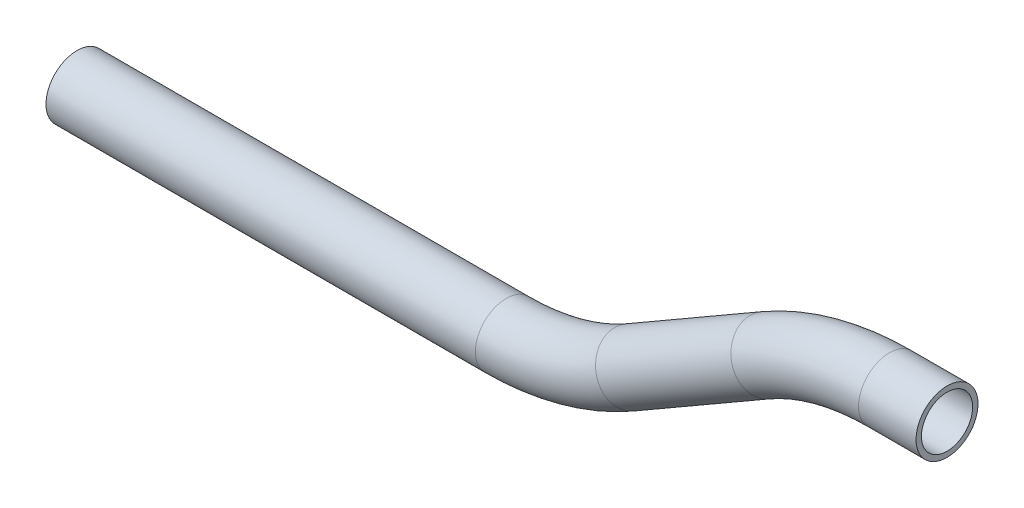
ISO-10303-21;
HEADER;
FILE_DESCRIPTION(('STEP AP214'),'2;1');
FILE_NAME('part.step','',(''),(''),'','','');
FILE_SCHEMA(('AUTOMOTIVE_DESIGN { 1 0 10303 214 1 1 1 1 }'));
ENDSEC;
DATA;
#1=APPLICATION_CONTEXT('core data for automotive mechanical design processes');
#2=APPLICATION_PROTOCOL_DEFINITION('international standard','automotive_design',2000,#1);
#3=PRODUCT_CONTEXT('',#1,'mechanical');
#4=PRODUCT('Part','Part','',(#3));
#5=PRODUCT_RELATED_PRODUCT_CATEGORY('part','',(#4));
#6=PRODUCT_DEFINITION_FORMATION('','',#4);
#7=PRODUCT_DEFINITION_CONTEXT('part definition',#1,'design');
#8=PRODUCT_DEFINITION('design','',#6,#7);
#9=PRODUCT_DEFINITION_SHAPE('','',#8);
#10=(LENGTH_UNIT() NAMED_UNIT(*) SI_UNIT(.MILLI.,.METRE.));
#11=(NAMED_UNIT(*) PLANE_ANGLE_UNIT() SI_UNIT($,.RADIAN.));
#12=(NAMED_UNIT(*) SI_UNIT($,.STERADIAN.) SOLID_ANGLE_UNIT());
#13=UNCERTAINTY_MEASURE_WITH_UNIT(LENGTH_MEASURE(1.E-05),#10,'distance_accuracy_value','');
#14=(GEOMETRIC_REPRESENTATION_CONTEXT(3) GLOBAL_UNCERTAINTY_ASSIGNED_CONTEXT((#13)) GLOBAL_UNIT_ASSIGNED_CONTEXT((#10,
#11,#12)) REPRESENTATION_CONTEXT('',''));
#15=CARTESIAN_POINT('',(0.,0.,0.));
#16=DIRECTION('',(0.,0.,1.));
#17=DIRECTION('',(1.,0.,0.));
#18=AXIS2_PLACEMENT_3D('',#15,#16,#17);
#19=CARTESIAN_POINT('',(45.2161884712732,15.1508063567214,0.));
#20=DIRECTION('',(-1.,0.,0.));
#21=DIRECTION('',(0.,-1.,0.));
#22=AXIS2_PLACEMENT_3D('',#19,#20,#21);
#23=CYLINDRICAL_SURFACE('',#22,9.525);
#24=CARTESIAN_POINT('',(27.5339169345249,15.1508063567214,0.));
#25=DIRECTION('',(-1.,0.,0.));
#26=DIRECTION('',(0.,-1.,0.));
#27=AXIS2_PLACEMENT_3D('',#24,#25,#26);
#28=CIRCLE('',#27,9.525);
#29=CARTESIAN_POINT('',(27.5339169345249,24.6758063567214,0.));
#30=VERTEX_POINT('',#29);
#31=EDGE_CURVE('E65',#30,#30,#28,.T.);
#32=ORIENTED_EDGE('',*,*,#31,.F.);
#33=EDGE_LOOP('',(#32));
#34=FACE_BOUND('',#33,.T.);
#35=CARTESIAN_POINT('',(45.2161884712732,15.1508063567214,0.));
#36=DIRECTION('',(-1.,0.,0.));
#37=DIRECTION('',(0.,-1.,0.));
#38=AXIS2_PLACEMENT_3D('',#35,#36,#37);
#39=CIRCLE('',#38,9.525);
#40=CARTESIAN_POINT('',(45.2161884712732,5.62580635672139,0.));
#41=VERTEX_POINT('',#40);
#42=EDGE_CURVE('E61',#41,#41,#39,.T.);
#43=ORIENTED_EDGE('',*,*,#42,.T.);
#44=EDGE_LOOP('',(#43));
#45=FACE_BOUND('',#44,.T.);
#46=ADVANCED_FACE('F37',(#34,#45),#23,.T.);
#47=CARTESIAN_POINT('',(27.5339169345249,-61.0491936432786,0.));
#48=DIRECTION('',(0.,0.,1.));
#49=DIRECTION('',(1.,0.,0.));
#50=AXIS2_PLACEMENT_3D('',#47,#48,#49);
#51=TOROIDAL_SURFACE('',#50,76.2,9.525);
#52=CARTESIAN_POINT('',(-10.5660830654752,4.94194212509554,0.));
#53=DIRECTION('',(-0.866025403784438,-0.500000000000001,0.));
#54=DIRECTION('',(0.500000000000001,-0.866025403784438,0.));
#55=AXIS2_PLACEMENT_3D('',#52,#53,#54);
#56=CIRCLE('',#55,9.525);
#57=CARTESIAN_POINT('',(-15.3285830654752,13.1908340961423,0.));
#58=VERTEX_POINT('',#57);
#59=EDGE_CURVE('E69',#58,#58,#56,.T.);
#60=CARTESIAN_POINT('',(27.5339169345249,-61.0491936432786,0.));
#61=DIRECTION('',(0.,0.,1.));
#62=DIRECTION('',(1.,0.,0.));
#63=AXIS2_PLACEMENT_3D('',#60,#61,#62);
#64=CIRCLE('',#63,85.725);
#65=EDGE_CURVE('',#30,#58,#64,.T.);
#66=ORIENTED_EDGE('',*,*,#31,.T.);
#67=ORIENTED_EDGE('',*,*,#59,.F.);
#68=ORIENTED_EDGE('',*,*,#65,.T.);
#69=ORIENTED_EDGE('',*,*,#65,.F.);
#70=EDGE_LOOP('',(#66,#68,#67,#69));
#71=FACE_BOUND('',#70,.T.);
#72=ADVANCED_FACE('F91',(#71),#51,.T.);
#73=CARTESIAN_POINT('',(-10.5660830654752,4.94194212509554,0.));
#74=DIRECTION('',(-0.866025403784436,-0.500000000000004,0.));
#75=DIRECTION('',(0.500000000000004,-0.866025403784436,0.));
#76=AXIS2_PLACEMENT_3D('',#73,#74,#75);
#77=CYLINDRICAL_SURFACE('',#76,9.525);
#78=CARTESIAN_POINT('',(-52.1911983884148,-19.0903294116531,0.));
#79=DIRECTION('',(-0.866025403784436,-0.500000000000004,0.));
#80=DIRECTION('',(0.500000000000004,-0.866025403784436,0.));
#81=AXIS2_PLACEMENT_3D('',#78,#79,#80);
#82=CIRCLE('',#81,9.525);
#83=CARTESIAN_POINT('',(-47.4286983884148,-27.3392213826999,0.));
#84=VERTEX_POINT('',#83);
#85=EDGE_CURVE('E72',#84,#84,#82,.T.);
#86=ORIENTED_EDGE('',*,*,#85,.F.);
#87=EDGE_LOOP('',(#86));
#88=FACE_BOUND('',#87,.T.);
#89=ORIENTED_EDGE('',*,*,#59,.T.);
#90=EDGE_LOOP('',(#89));
#91=FACE_BOUND('',#90,.T.);
#92=ADVANCED_FACE('F84',(#88,#91),#77,.T.);
#93=CARTESIAN_POINT('',(-90.2911983884149,46.9008063567211,0.));
#94=DIRECTION('',(0.,0.,-1.));
#95=DIRECTION('',(-1.,0.,0.));
#96=AXIS2_PLACEMENT_3D('',#93,#94,#95);
#97=TOROIDAL_SURFACE('',#96,76.2,9.525);
#98=CARTESIAN_POINT('',(-90.2911983884148,-29.299193643279,0.));
#99=DIRECTION('',(-1.,0.,0.));
#100=DIRECTION('',(0.,-1.,0.));
#101=AXIS2_PLACEMENT_3D('',#98,#99,#100);
#102=CIRCLE('',#101,9.525);
#103=CARTESIAN_POINT('',(-90.2911983884148,-38.8241936432789,0.));
#104=VERTEX_POINT('',#103);
#105=EDGE_CURVE('E41',#104,#104,#102,.T.);
#106=CARTESIAN_POINT('',(-90.2911983884149,46.9008063567211,0.));
#107=DIRECTION('',(0.,0.,-1.));
#108=DIRECTION('',(-1.,0.,0.));
#109=AXIS2_PLACEMENT_3D('',#106,#107,#108);
#110=CIRCLE('',#109,85.725);
#111=EDGE_CURVE('',#84,#104,#110,.T.);
#112=ORIENTED_EDGE('',*,*,#85,.T.);
#113=ORIENTED_EDGE('',*,*,#105,.F.);
#114=ORIENTED_EDGE('',*,*,#111,.T.);
#115=ORIENTED_EDGE('',*,*,#111,.F.);
#116=EDGE_LOOP('',(#112,#114,#113,#115));
#117=FACE_BOUND('',#116,.T.);
#118=ADVANCED_FACE('F82',(#117),#97,.T.);
#119=CARTESIAN_POINT('',(-90.2911983884148,-29.2991936432789,0.));
#120=DIRECTION('',(-1.,0.,0.));
#121=DIRECTION('',(0.,-1.,0.));
#122=AXIS2_PLACEMENT_3D('',#119,#120,#121);
#123=CYLINDRICAL_SURFACE('',#122,9.525);
#124=CARTESIAN_POINT('',(-222.273469925163,-29.2991936432789,0.));
#125=DIRECTION('',(-1.,0.,0.));
#126=DIRECTION('',(0.,-1.,0.));
#127=AXIS2_PLACEMENT_3D('',#124,#125,#126);
#128=CIRCLE('',#127,9.525);
#129=CARTESIAN_POINT('',(-222.273469925163,-38.8241936432789,0.));
#130=VERTEX_POINT('',#129);
#131=EDGE_CURVE('E56',#130,#130,#128,.T.);
#132=ORIENTED_EDGE('',*,*,#131,.F.);
#133=EDGE_LOOP('',(#132));
#134=FACE_BOUND('',#133,.T.);
#135=ORIENTED_EDGE('',*,*,#105,.T.);
#136=EDGE_LOOP('',(#135));
#137=FACE_BOUND('',#136,.T.);
#138=ADVANCED_FACE('F39',(#134,#137),#123,.T.);
#139=CARTESIAN_POINT('',(45.2161884712732,15.1508063567214,0.));
#140=DIRECTION('',(-1.,0.,0.));
#141=DIRECTION('',(0.,-1.,0.));
#142=AXIS2_PLACEMENT_3D('',#139,#140,#141);
#143=PLANE('',#142);
#144=CARTESIAN_POINT('',(45.2161884712732,15.1508063567214,0.));
#145=DIRECTION('',(-1.,0.,0.));
#146=DIRECTION('',(0.,-1.,0.));
#147=AXIS2_PLACEMENT_3D('',#144,#145,#146);
#148=CIRCLE('',#147,7.874);
#149=CARTESIAN_POINT('',(45.2161884712732,7.27680635672139,0.));
#150=VERTEX_POINT('',#149);
#151=EDGE_CURVE('E60',#150,#150,#148,.F.);
#152=ORIENTED_EDGE('',*,*,#151,.F.);
#153=EDGE_LOOP('',(#152));
#154=FACE_BOUND('',#153,.T.);
#155=ORIENTED_EDGE('',*,*,#42,.F.);
#156=EDGE_LOOP('',(#155));
#157=FACE_BOUND('',#156,.T.);
#158=ADVANCED_FACE('F89',(#154,#157),#143,.F.);
#159=CARTESIAN_POINT('',(-222.273469925163,-29.2991936432789,0.));
#160=DIRECTION('',(-1.,0.,0.));
#161=DIRECTION('',(0.,-1.,0.));
#162=AXIS2_PLACEMENT_3D('',#159,#160,#161);
#163=PLANE('',#162);
#164=CARTESIAN_POINT('',(-222.273469925163,-29.2991936432789,0.));
#165=DIRECTION('',(-1.,0.,0.));
#166=DIRECTION('',(0.,-1.,0.));
#167=AXIS2_PLACEMENT_3D('',#164,#165,#166);
#168=CIRCLE('',#167,7.874);
#169=CARTESIAN_POINT('',(-222.273469925163,-37.1731936432789,0.));
#170=VERTEX_POINT('',#169);
#171=EDGE_CURVE('E10',#170,#170,#168,.F.);
#172=ORIENTED_EDGE('',*,*,#171,.T.);
#173=EDGE_LOOP('',(#172));
#174=FACE_BOUND('',#173,.T.);
#175=ORIENTED_EDGE('',*,*,#131,.T.);
#176=EDGE_LOOP('',(#175));
#177=FACE_BOUND('',#176,.T.);
#178=ADVANCED_FACE('F108',(#174,#177),#163,.T.);
#179=CARTESIAN_POINT('',(45.2161884712732,15.1508063567214,0.));
#180=DIRECTION('',(-1.,0.,0.));
#181=DIRECTION('',(0.,-1.,0.));
#182=AXIS2_PLACEMENT_3D('',#179,#180,#181);
#183=CYLINDRICAL_SURFACE('',#182,7.874);
#184=CARTESIAN_POINT('',(27.5339169345249,15.1508063567214,0.));
#185=DIRECTION('',(-1.,0.,0.));
#186=DIRECTION('',(0.,-1.,0.));
#187=AXIS2_PLACEMENT_3D('',#184,#185,#186);
#188=CIRCLE('',#187,7.874);
#189=CARTESIAN_POINT('',(27.5339169345249,23.0248063567214,0.));
#190=VERTEX_POINT('',#189);
#191=EDGE_CURVE('E205',#190,#190,#188,.F.);
#192=ORIENTED_EDGE('',*,*,#191,.F.);
#193=EDGE_LOOP('',(#192));
#194=FACE_BOUND('',#193,.T.);
#195=ORIENTED_EDGE('',*,*,#151,.T.);
#196=EDGE_LOOP('',(#195));
#197=FACE_BOUND('',#196,.T.);
#198=ADVANCED_FACE('F111',(#194,#197),#183,.F.);
#199=CARTESIAN_POINT('',(27.5339169345249,-61.0491936432786,0.));
#200=DIRECTION('',(0.,0.,1.));
#201=DIRECTION('',(1.,0.,0.));
#202=AXIS2_PLACEMENT_3D('',#199,#200,#201);
#203=TOROIDAL_SURFACE('',#202,76.2,7.874);
#204=CARTESIAN_POINT('',(-10.5660830654752,4.94194212509554,0.));
#205=DIRECTION('',(-0.866025403784438,-0.500000000000001,0.));
#206=DIRECTION('',(0.500000000000001,-0.866025403784438,0.));
#207=AXIS2_PLACEMENT_3D('',#204,#205,#206);
#208=CIRCLE('',#207,7.874);
#209=CARTESIAN_POINT('',(-14.5030830654752,11.7610261544942,0.));
#210=VERTEX_POINT('',#209);
#211=EDGE_CURVE('E203',#210,#210,#208,.F.);
#212=CARTESIAN_POINT('',(27.5339169345249,-61.0491936432786,0.));
#213=DIRECTION('',(0.,0.,1.));
#214=DIRECTION('',(1.,0.,0.));
#215=AXIS2_PLACEMENT_3D('',#212,#213,#214);
#216=CIRCLE('',#215,84.074);
#217=EDGE_CURVE('',#190,#210,#216,.T.);
#218=ORIENTED_EDGE('',*,*,#191,.T.);
#219=ORIENTED_EDGE('',*,*,#211,.F.);
#220=ORIENTED_EDGE('',*,*,#217,.T.);
#221=ORIENTED_EDGE('',*,*,#217,.F.);
#222=EDGE_LOOP('',(#218,#220,#219,#221));
#223=FACE_BOUND('',#222,.T.);
#224=ADVANCED_FACE('F166',(#223),#203,.F.);
#225=CARTESIAN_POINT('',(-10.5660830654752,4.94194212509554,0.));
#226=DIRECTION('',(-0.866025403784436,-0.500000000000004,0.));
#227=DIRECTION('',(0.500000000000004,-0.866025403784436,0.));
#228=AXIS2_PLACEMENT_3D('',#225,#226,#227);
#229=CYLINDRICAL_SURFACE('',#228,7.874);
#230=CARTESIAN_POINT('',(-52.1911983884148,-19.0903294116531,0.));
#231=DIRECTION('',(-0.866025403784436,-0.500000000000004,0.));
#232=DIRECTION('',(0.500000000000004,-0.866025403784436,0.));
#233=AXIS2_PLACEMENT_3D('',#230,#231,#232);
#234=CIRCLE('',#233,7.874);
#235=CARTESIAN_POINT('',(-48.2541983884148,-25.9094134410518,0.));
#236=VERTEX_POINT('',#235);
#237=EDGE_CURVE('E52',#236,#236,#234,.F.);
#238=ORIENTED_EDGE('',*,*,#237,.F.);
#239=EDGE_LOOP('',(#238));
#240=FACE_BOUND('',#239,.T.);
#241=ORIENTED_EDGE('',*,*,#211,.T.);
#242=EDGE_LOOP('',(#241));
#243=FACE_BOUND('',#242,.T.);
#244=ADVANCED_FACE('F102',(#240,#243),#229,.F.);
#245=CARTESIAN_POINT('',(-90.2911983884149,46.9008063567211,0.));
#246=DIRECTION('',(0.,0.,-1.));
#247=DIRECTION('',(-1.,0.,0.));
#248=AXIS2_PLACEMENT_3D('',#245,#246,#247);
#249=TOROIDAL_SURFACE('',#248,76.2,7.874);
#250=CARTESIAN_POINT('',(-90.2911983884148,-29.299193643279,0.));
#251=DIRECTION('',(-1.,0.,0.));
#252=DIRECTION('',(0.,-1.,0.));
#253=AXIS2_PLACEMENT_3D('',#250,#251,#252);
#254=CIRCLE('',#253,7.874);
#255=CARTESIAN_POINT('',(-90.2911983884148,-37.1731936432789,0.));
#256=VERTEX_POINT('',#255);
#257=EDGE_CURVE('E46',#256,#256,#254,.F.);
#258=CARTESIAN_POINT('',(-90.2911983884149,46.9008063567211,0.));
#259=DIRECTION('',(0.,0.,-1.));
#260=DIRECTION('',(-1.,0.,0.));
#261=AXIS2_PLACEMENT_3D('',#258,#259,#260);
#262=CIRCLE('',#261,84.074);
#263=EDGE_CURVE('',#236,#256,#262,.T.);
#264=ORIENTED_EDGE('',*,*,#237,.T.);
#265=ORIENTED_EDGE('',*,*,#257,.F.);
#266=ORIENTED_EDGE('',*,*,#263,.T.);
#267=ORIENTED_EDGE('',*,*,#263,.F.);
#268=EDGE_LOOP('',(#264,#266,#265,#267));
#269=FACE_BOUND('',#268,.T.);
#270=ADVANCED_FACE('F96',(#269),#249,.F.);
#271=CARTESIAN_POINT('',(-90.2911983884148,-29.2991936432789,0.));
#272=DIRECTION('',(-1.,0.,0.));
#273=DIRECTION('',(0.,-1.,0.));
#274=AXIS2_PLACEMENT_3D('',#271,#272,#273);
#275=CYLINDRICAL_SURFACE('',#274,7.874);
#276=ORIENTED_EDGE('',*,*,#171,.F.);
#277=EDGE_LOOP('',(#276));
#278=FACE_BOUND('',#277,.T.);
#279=ORIENTED_EDGE('',*,*,#257,.T.);
#280=EDGE_LOOP('',(#279));
#281=FACE_BOUND('',#280,.T.);
#282=ADVANCED_FACE('F94',(#278,#281),#275,.F.);
#283=CLOSED_SHELL('',(#46,#72,#92,#118,#138,#158,#178,#198,#224,#244,#270,#282));
#284=MANIFOLD_SOLID_BREP('B2',#283);
#285=ADVANCED_BREP_SHAPE_REPRESENTATION('',(#18,#284),#14);
#286=SHAPE_DEFINITION_REPRESENTATION(#9,#285);
ENDSEC;
END-ISO-10303-21;
